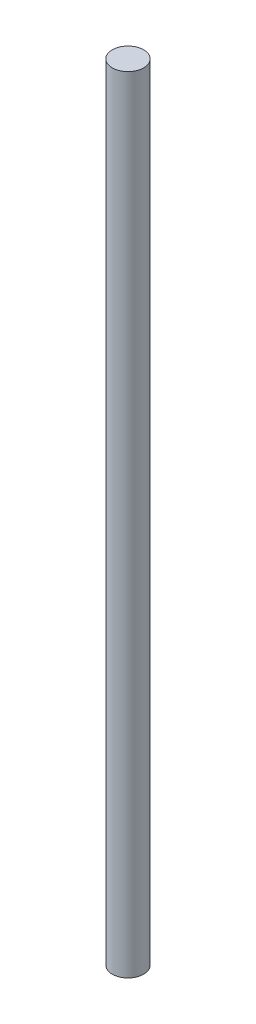
ISO-10303-21;
HEADER;
FILE_DESCRIPTION(('STEP AP214'),'2;1');
FILE_NAME('part.step','',(''),(''),'','','');
FILE_SCHEMA(('AUTOMOTIVE_DESIGN { 1 0 10303 214 1 1 1 1 }'));
ENDSEC;
DATA;
#1=APPLICATION_CONTEXT('core data for automotive mechanical design processes');
#2=APPLICATION_PROTOCOL_DEFINITION('international standard','automotive_design',2000,#1);
#3=PRODUCT_CONTEXT('',#1,'mechanical');
#4=PRODUCT('Part','Part','',(#3));
#5=PRODUCT_RELATED_PRODUCT_CATEGORY('part','',(#4));
#6=PRODUCT_DEFINITION_FORMATION('','',#4);
#7=PRODUCT_DEFINITION_CONTEXT('part definition',#1,'design');
#8=PRODUCT_DEFINITION('design','',#6,#7);
#9=PRODUCT_DEFINITION_SHAPE('','',#8);
#10=(LENGTH_UNIT() NAMED_UNIT(*) SI_UNIT(.MILLI.,.METRE.));
#11=(NAMED_UNIT(*) PLANE_ANGLE_UNIT() SI_UNIT($,.RADIAN.));
#12=(NAMED_UNIT(*) SI_UNIT($,.STERADIAN.) SOLID_ANGLE_UNIT());
#13=UNCERTAINTY_MEASURE_WITH_UNIT(LENGTH_MEASURE(1.E-05),#10,'distance_accuracy_value','');
#14=(GEOMETRIC_REPRESENTATION_CONTEXT(3) GLOBAL_UNCERTAINTY_ASSIGNED_CONTEXT((#13)) GLOBAL_UNIT_ASSIGNED_CONTEXT((#10,
#11,#12)) REPRESENTATION_CONTEXT('',''));
#15=CARTESIAN_POINT('',(0.,0.,0.));
#16=DIRECTION('',(0.,0.,1.));
#17=DIRECTION('',(1.,0.,0.));
#18=AXIS2_PLACEMENT_3D('',#15,#16,#17);
#19=CARTESIAN_POINT('',(0.,200.,0.));
#20=DIRECTION('',(0.,-1.,0.));
#21=DIRECTION('',(0.,0.,-1.));
#22=AXIS2_PLACEMENT_3D('',#19,#20,#21);
#23=CYLINDRICAL_SURFACE('',#22,4.);
#24=CARTESIAN_POINT('',(0.,200.,0.));
#25=DIRECTION('',(0.,1.,0.));
#26=DIRECTION('',(0.,0.,1.));
#27=AXIS2_PLACEMENT_3D('',#24,#25,#26);
#28=CIRCLE('',#27,4.);
#29=CARTESIAN_POINT('',(0.,200.,4.));
#30=VERTEX_POINT('',#29);
#31=EDGE_CURVE('E10',#30,#30,#28,.T.);
#32=ORIENTED_EDGE('',*,*,#31,.F.);
#33=EDGE_LOOP('',(#32));
#34=FACE_BOUND('',#33,.T.);
#35=CARTESIAN_POINT('',(0.,0.,0.));
#36=DIRECTION('',(0.,1.,0.));
#37=DIRECTION('',(0.,0.,1.));
#38=AXIS2_PLACEMENT_3D('',#35,#36,#37);
#39=CIRCLE('',#38,4.);
#40=CARTESIAN_POINT('',(0.,0.,4.));
#41=VERTEX_POINT('',#40);
#42=EDGE_CURVE('E40',#41,#41,#39,.T.);
#43=ORIENTED_EDGE('',*,*,#42,.T.);
#44=EDGE_LOOP('',(#43));
#45=FACE_BOUND('',#44,.T.);
#46=ADVANCED_FACE('F37',(#34,#45),#23,.T.);
#47=CARTESIAN_POINT('',(0.,200.,0.));
#48=DIRECTION('',(0.,1.,0.));
#49=DIRECTION('',(0.,0.,1.));
#50=AXIS2_PLACEMENT_3D('',#47,#48,#49);
#51=PLANE('',#50);
#52=ORIENTED_EDGE('',*,*,#31,.T.);
#53=EDGE_LOOP('',(#52));
#54=FACE_BOUND('',#53,.T.);
#55=ADVANCED_FACE('F54',(#54),#51,.T.);
#56=CARTESIAN_POINT('',(0.,0.,0.));
#57=DIRECTION('',(0.,1.,0.));
#58=DIRECTION('',(0.,0.,1.));
#59=AXIS2_PLACEMENT_3D('',#56,#57,#58);
#60=PLANE('',#59);
#61=ORIENTED_EDGE('',*,*,#42,.F.);
#62=EDGE_LOOP('',(#61));
#63=FACE_BOUND('',#62,.T.);
#64=ADVANCED_FACE('F52',(#63),#60,.F.);
#65=CLOSED_SHELL('',(#46,#55,#64));
#66=MANIFOLD_SOLID_BREP('B2',#65);
#67=ADVANCED_BREP_SHAPE_REPRESENTATION('',(#18,#66),#14);
#68=SHAPE_DEFINITION_REPRESENTATION(#9,#67);
ENDSEC;
END-ISO-10303-21;
